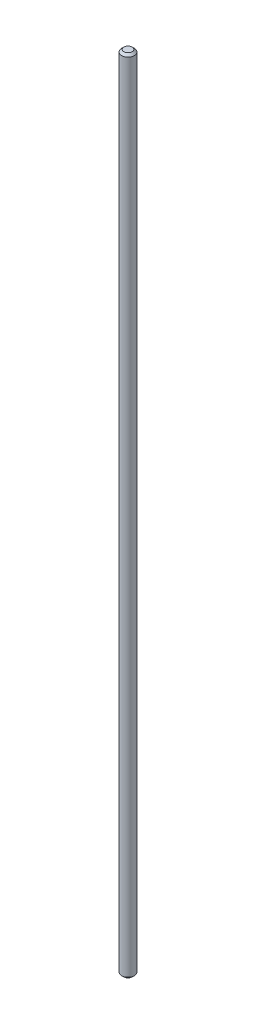
ISO-10303-21;
HEADER;
FILE_DESCRIPTION(('STEP AP214'),'2;1');
FILE_NAME('part.step','',(''),(''),'','','');
FILE_SCHEMA(('AUTOMOTIVE_DESIGN { 1 0 10303 214 1 1 1 1 }'));
ENDSEC;
DATA;
#1=APPLICATION_CONTEXT('core data for automotive mechanical design processes');
#2=APPLICATION_PROTOCOL_DEFINITION('international standard','automotive_design',2000,#1);
#3=PRODUCT_CONTEXT('',#1,'mechanical');
#4=PRODUCT('Part','Part','',(#3));
#5=PRODUCT_RELATED_PRODUCT_CATEGORY('part','',(#4));
#6=PRODUCT_DEFINITION_FORMATION('','',#4);
#7=PRODUCT_DEFINITION_CONTEXT('part definition',#1,'design');
#8=PRODUCT_DEFINITION('design','',#6,#7);
#9=PRODUCT_DEFINITION_SHAPE('','',#8);
#10=(LENGTH_UNIT() NAMED_UNIT(*) SI_UNIT(.MILLI.,.METRE.));
#11=(NAMED_UNIT(*) PLANE_ANGLE_UNIT() SI_UNIT($,.RADIAN.));
#12=(NAMED_UNIT(*) SI_UNIT($,.STERADIAN.) SOLID_ANGLE_UNIT());
#13=UNCERTAINTY_MEASURE_WITH_UNIT(LENGTH_MEASURE(1.E-05),#10,'distance_accuracy_value','');
#14=(GEOMETRIC_REPRESENTATION_CONTEXT(3) GLOBAL_UNCERTAINTY_ASSIGNED_CONTEXT((#13)) GLOBAL_UNIT_ASSIGNED_CONTEXT((#10,
#11,#12)) REPRESENTATION_CONTEXT('',''));
#15=CARTESIAN_POINT('',(0.,0.,0.));
#16=DIRECTION('',(0.,0.,1.));
#17=DIRECTION('',(1.,0.,0.));
#18=AXIS2_PLACEMENT_3D('',#15,#16,#17);
#19=CARTESIAN_POINT('',(1.025,0.,0.));
#20=DIRECTION('',(0.,1.,0.));
#21=DIRECTION('',(0.,0.,1.));
#22=AXIS2_PLACEMENT_3D('',#19,#20,#21);
#23=PLANE('',#22);
#24=CARTESIAN_POINT('',(0.,0.,0.));
#25=DIRECTION('',(0.,-1.,0.));
#26=DIRECTION('',(0.,0.,-1.));
#27=AXIS2_PLACEMENT_3D('',#24,#25,#26);
#28=CIRCLE('',#27,2.049999999997);
#29=CARTESIAN_POINT('',(0.,0.,-2.049999999997));
#30=VERTEX_POINT('',#29);
#31=EDGE_CURVE('E17',#30,#30,#28,.T.);
#32=ORIENTED_EDGE('',*,*,#31,.F.);
#33=EDGE_LOOP('',(#32));
#34=FACE_BOUND('',#33,.T.);
#35=ADVANCED_FACE('F14',(#34),#23,.T.);
#36=CARTESIAN_POINT('',(1.025,-400.,0.));
#37=DIRECTION('',(0.,-1.,0.));
#38=DIRECTION('',(0.,0.,-1.));
#39=AXIS2_PLACEMENT_3D('',#36,#37,#38);
#40=PLANE('',#39);
#41=CARTESIAN_POINT('',(0.,-400.000000000034,0.));
#42=DIRECTION('',(0.,1.,0.));
#43=DIRECTION('',(0.,0.,1.));
#44=AXIS2_PLACEMENT_3D('',#41,#42,#43);
#45=CIRCLE('',#44,2.049999999997);
#46=CARTESIAN_POINT('',(0.,-400.000000000034,2.049999999997));
#47=VERTEX_POINT('',#46);
#48=EDGE_CURVE('E29',#47,#47,#45,.T.);
#49=ORIENTED_EDGE('',*,*,#48,.F.);
#50=EDGE_LOOP('',(#49));
#51=FACE_BOUND('',#50,.T.);
#52=ADVANCED_FACE('F43',(#51),#40,.T.);
#53=CARTESIAN_POINT('',(0.,-1.12500000005866,0.));
#54=DIRECTION('',(0.,-1.,0.));
#55=DIRECTION('',(0.,0.,-1.));
#56=AXIS2_PLACEMENT_3D('',#53,#54,#55);
#57=CONICAL_SURFACE('',#56,3.17499999999882,0.785398163372185);
#58=ORIENTED_EDGE('',*,*,#31,.T.);
#59=EDGE_LOOP('',(#58));
#60=FACE_BOUND('',#59,.T.);
#61=CARTESIAN_POINT('',(0.,-1.12499999999999,0.));
#62=DIRECTION('',(0.,-1.,0.));
#63=DIRECTION('',(0.,0.,-1.));
#64=AXIS2_PLACEMENT_3D('',#61,#62,#63);
#65=CIRCLE('',#64,3.175);
#66=CARTESIAN_POINT('',(0.,-1.12499999999999,-3.175));
#67=VERTEX_POINT('',#66);
#68=EDGE_CURVE('E22',#67,#67,#65,.T.);
#69=ORIENTED_EDGE('',*,*,#68,.F.);
#70=EDGE_LOOP('',(#69));
#71=FACE_BOUND('',#70,.T.);
#72=ADVANCED_FACE('F39',(#60,#71),#57,.T.);
#73=CARTESIAN_POINT('',(0.,-398.875000000032,0.));
#74=DIRECTION('',(0.,1.,0.));
#75=DIRECTION('',(0.,0.,1.));
#76=AXIS2_PLACEMENT_3D('',#73,#74,#75);
#77=CONICAL_SURFACE('',#76,3.17499999999882,0.785398163397448);
#78=ORIENTED_EDGE('',*,*,#48,.T.);
#79=EDGE_LOOP('',(#78));
#80=FACE_BOUND('',#79,.T.);
#81=CARTESIAN_POINT('',(0.,-398.875,0.));
#82=DIRECTION('',(0.,-1.,0.));
#83=DIRECTION('',(0.,0.,-1.));
#84=AXIS2_PLACEMENT_3D('',#81,#82,#83);
#85=CIRCLE('',#84,3.175);
#86=CARTESIAN_POINT('',(0.,-398.875,-3.175));
#87=VERTEX_POINT('',#86);
#88=EDGE_CURVE('E10',#87,#87,#85,.F.);
#89=ORIENTED_EDGE('',*,*,#88,.F.);
#90=EDGE_LOOP('',(#89));
#91=FACE_BOUND('',#90,.T.);
#92=ADVANCED_FACE('F50',(#80,#91),#77,.T.);
#93=CARTESIAN_POINT('',(0.,-200.,0.));
#94=DIRECTION('',(0.,-1.,0.));
#95=DIRECTION('',(0.,0.,-1.));
#96=AXIS2_PLACEMENT_3D('',#93,#94,#95);
#97=CYLINDRICAL_SURFACE('',#96,3.175);
#98=ORIENTED_EDGE('',*,*,#68,.T.);
#99=EDGE_LOOP('',(#98));
#100=FACE_BOUND('',#99,.T.);
#101=ORIENTED_EDGE('',*,*,#88,.T.);
#102=EDGE_LOOP('',(#101));
#103=FACE_BOUND('',#102,.T.);
#104=ADVANCED_FACE('F48',(#100,#103),#97,.T.);
#105=CLOSED_SHELL('',(#35,#52,#72,#92,#104));
#106=MANIFOLD_SOLID_BREP('B1',#105);
#107=ADVANCED_BREP_SHAPE_REPRESENTATION('',(#18,#106),#14);
#108=SHAPE_DEFINITION_REPRESENTATION(#9,#107);
ENDSEC;
END-ISO-10303-21;
